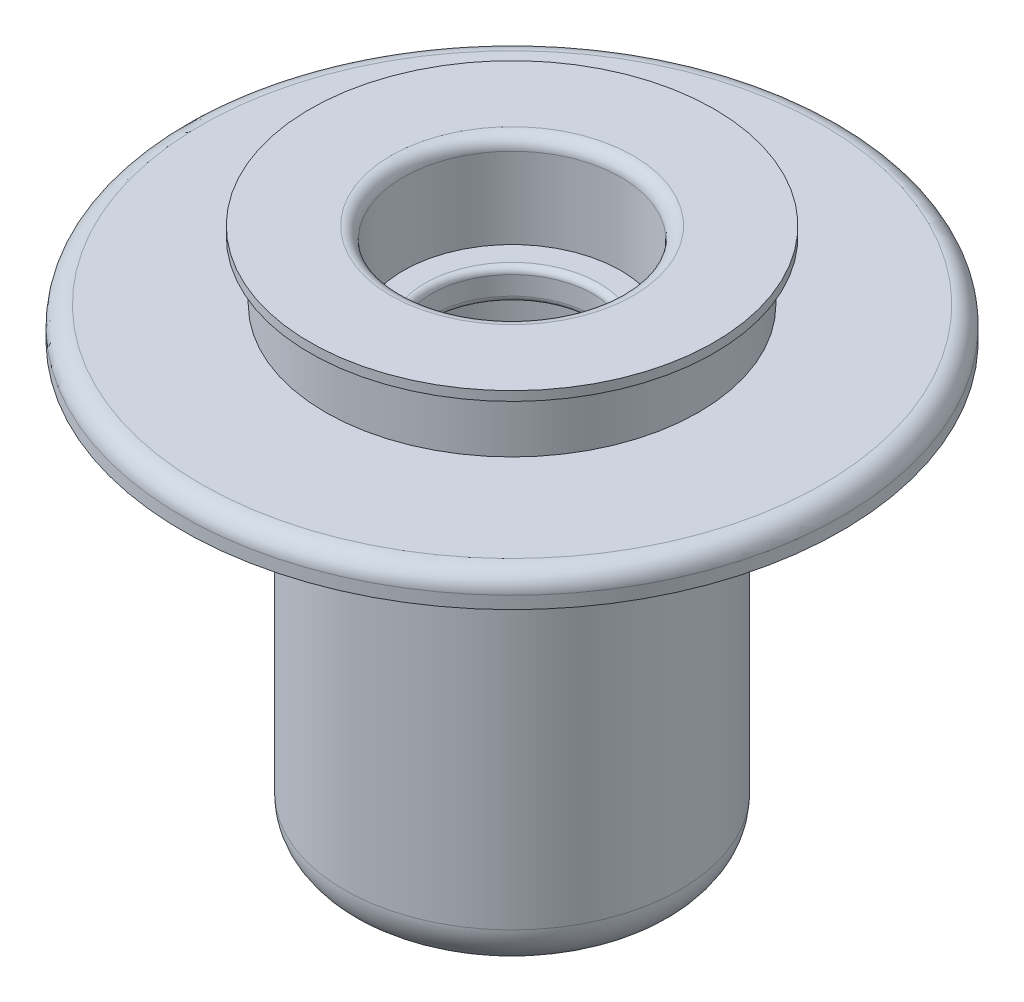
ISO-10303-21;
HEADER;
FILE_DESCRIPTION(('STEP AP214'),'2;1');
FILE_NAME('part.step','',(''),(''),'','','');
FILE_SCHEMA(('AUTOMOTIVE_DESIGN { 1 0 10303 214 1 1 1 1 }'));
ENDSEC;
DATA;
#1=APPLICATION_CONTEXT('core data for automotive mechanical design processes');
#2=APPLICATION_PROTOCOL_DEFINITION('international standard','automotive_design',2000,#1);
#3=PRODUCT_CONTEXT('',#1,'mechanical');
#4=PRODUCT('Part','Part','',(#3));
#5=PRODUCT_RELATED_PRODUCT_CATEGORY('part','',(#4));
#6=PRODUCT_DEFINITION_FORMATION('','',#4);
#7=PRODUCT_DEFINITION_CONTEXT('part definition',#1,'design');
#8=PRODUCT_DEFINITION('design','',#6,#7);
#9=PRODUCT_DEFINITION_SHAPE('','',#8);
#10=(LENGTH_UNIT() NAMED_UNIT(*) SI_UNIT(.MILLI.,.METRE.));
#11=(NAMED_UNIT(*) PLANE_ANGLE_UNIT() SI_UNIT($,.RADIAN.));
#12=(NAMED_UNIT(*) SI_UNIT($,.STERADIAN.) SOLID_ANGLE_UNIT());
#13=UNCERTAINTY_MEASURE_WITH_UNIT(LENGTH_MEASURE(1.E-05),#10,'distance_accuracy_value','');
#14=(GEOMETRIC_REPRESENTATION_CONTEXT(3) GLOBAL_UNCERTAINTY_ASSIGNED_CONTEXT((#13)) GLOBAL_UNIT_ASSIGNED_CONTEXT((#10,
#11,#12)) REPRESENTATION_CONTEXT('',''));
#15=CARTESIAN_POINT('',(0.,0.,0.));
#16=DIRECTION('',(0.,0.,1.));
#17=DIRECTION('',(1.,0.,0.));
#18=AXIS2_PLACEMENT_3D('',#15,#16,#17);
#19=CARTESIAN_POINT('',(50.,84.75825159929,0.));
#20=DIRECTION('',(0.,1.,0.));
#21=DIRECTION('',(0.,0.,1.));
#22=AXIS2_PLACEMENT_3D('',#19,#20,#21);
#23=PLANE('',#22);
#24=CARTESIAN_POINT('',(0.,84.75825159929,0.));
#25=DIRECTION('',(0.,-1.,0.));
#26=DIRECTION('',(0.,0.,-1.));
#27=AXIS2_PLACEMENT_3D('',#24,#25,#26);
#28=CIRCLE('',#27,30.);
#29=CARTESIAN_POINT('',(0.,84.75825159929,-30.));
#30=VERTEX_POINT('',#29);
#31=EDGE_CURVE('E222',#30,#30,#28,.T.);
#32=ORIENTED_EDGE('',*,*,#31,.T.);
#33=EDGE_LOOP('',(#32));
#34=FACE_BOUND('',#33,.T.);
#35=CARTESIAN_POINT('',(0.,84.75825159929,0.));
#36=DIRECTION('',(0.,-1.,0.));
#37=DIRECTION('',(0.,0.,-1.));
#38=AXIS2_PLACEMENT_3D('',#35,#36,#37);
#39=CIRCLE('',#38,50.);
#40=CARTESIAN_POINT('',(0.,84.75825159929,-50.));
#41=VERTEX_POINT('',#40);
#42=EDGE_CURVE('E141',#41,#41,#39,.T.);
#43=ORIENTED_EDGE('',*,*,#42,.F.);
#44=EDGE_LOOP('',(#43));
#45=FACE_BOUND('',#44,.T.);
#46=ADVANCED_FACE('F33',(#34,#45),#23,.T.);
#47=CARTESIAN_POINT('',(0.,0.,0.));
#48=DIRECTION('',(0.,-1.,0.));
#49=DIRECTION('',(0.,0.,-1.));
#50=AXIS2_PLACEMENT_3D('',#47,#48,#49);
#51=CYLINDRICAL_SURFACE('',#50,30.);
#52=CARTESIAN_POINT('',(0.,94.25825159929,0.));
#53=DIRECTION('',(0.,-1.,0.));
#54=DIRECTION('',(0.,0.,-1.));
#55=AXIS2_PLACEMENT_3D('',#52,#53,#54);
#56=CIRCLE('',#55,30.);
#57=CARTESIAN_POINT('',(0.,94.25825159929,-30.));
#58=VERTEX_POINT('',#57);
#59=EDGE_CURVE('E219',#58,#58,#56,.T.);
#60=ORIENTED_EDGE('',*,*,#59,.T.);
#61=EDGE_LOOP('',(#60));
#62=FACE_BOUND('',#61,.T.);
#63=ORIENTED_EDGE('',*,*,#31,.F.);
#64=EDGE_LOOP('',(#63));
#65=FACE_BOUND('',#64,.T.);
#66=ADVANCED_FACE('F356',(#62,#65),#51,.T.);
#67=CARTESIAN_POINT('',(32.5,94.25825159929,0.));
#68=DIRECTION('',(0.,-1.,0.));
#69=DIRECTION('',(0.,0.,-1.));
#70=AXIS2_PLACEMENT_3D('',#67,#68,#69);
#71=PLANE('',#70);
#72=CARTESIAN_POINT('',(0.,94.25825159929,0.));
#73=DIRECTION('',(0.,-1.,0.));
#74=DIRECTION('',(0.,0.,-1.));
#75=AXIS2_PLACEMENT_3D('',#72,#73,#74);
#76=CIRCLE('',#75,32.5);
#77=CARTESIAN_POINT('',(0.,94.25825159929,-32.5));
#78=VERTEX_POINT('',#77);
#79=EDGE_CURVE('E216',#78,#78,#76,.T.);
#80=ORIENTED_EDGE('',*,*,#79,.T.);
#81=EDGE_LOOP('',(#80));
#82=FACE_BOUND('',#81,.T.);
#83=ORIENTED_EDGE('',*,*,#59,.F.);
#84=EDGE_LOOP('',(#83));
#85=FACE_BOUND('',#84,.T.);
#86=ADVANCED_FACE('F350',(#82,#85),#71,.T.);
#87=CARTESIAN_POINT('',(0.,0.,0.));
#88=DIRECTION('',(0.,-1.,0.));
#89=DIRECTION('',(0.,0.,-1.));
#90=AXIS2_PLACEMENT_3D('',#87,#88,#89);
#91=CYLINDRICAL_SURFACE('',#90,32.5);
#92=CARTESIAN_POINT('',(0.,95.75825159929,0.));
#93=DIRECTION('',(0.,-1.,0.));
#94=DIRECTION('',(0.,0.,-1.));
#95=AXIS2_PLACEMENT_3D('',#92,#93,#94);
#96=CIRCLE('',#95,32.5);
#97=CARTESIAN_POINT('',(0.,95.75825159929,-32.5));
#98=VERTEX_POINT('',#97);
#99=EDGE_CURVE('E213',#98,#98,#96,.T.);
#100=ORIENTED_EDGE('',*,*,#99,.T.);
#101=EDGE_LOOP('',(#100));
#102=FACE_BOUND('',#101,.T.);
#103=ORIENTED_EDGE('',*,*,#79,.F.);
#104=EDGE_LOOP('',(#103));
#105=FACE_BOUND('',#104,.T.);
#106=ADVANCED_FACE('F344',(#102,#105),#91,.T.);
#107=CARTESIAN_POINT('',(19.5,95.75825159929,0.));
#108=DIRECTION('',(0.,1.,0.));
#109=DIRECTION('',(0.,0.,1.));
#110=AXIS2_PLACEMENT_3D('',#107,#108,#109);
#111=PLANE('',#110);
#112=CARTESIAN_POINT('',(0.,95.75825159929,0.));
#113=DIRECTION('',(0.,-1.,0.));
#114=DIRECTION('',(0.,0.,-1.));
#115=AXIS2_PLACEMENT_3D('',#112,#113,#114);
#116=CIRCLE('',#115,19.5);
#117=CARTESIAN_POINT('',(0.,95.75825159929,-19.5));
#118=VERTEX_POINT('',#117);
#119=EDGE_CURVE('E210',#118,#118,#116,.T.);
#120=ORIENTED_EDGE('',*,*,#119,.T.);
#121=EDGE_LOOP('',(#120));
#122=FACE_BOUND('',#121,.T.);
#123=ORIENTED_EDGE('',*,*,#99,.F.);
#124=EDGE_LOOP('',(#123));
#125=FACE_BOUND('',#124,.T.);
#126=ADVANCED_FACE('F338',(#122,#125),#111,.T.);
#127=CARTESIAN_POINT('',(0.,93.75825159929,0.));
#128=DIRECTION('',(0.,-1.,0.));
#129=DIRECTION('',(0.,0.,-1.));
#130=AXIS2_PLACEMENT_3D('',#127,#128,#129);
#131=TOROIDAL_SURFACE('',#130,19.5,2.);
#132=CARTESIAN_POINT('',(0.,93.75825159929,0.));
#133=DIRECTION('',(0.,-1.,0.));
#134=DIRECTION('',(0.,0.,-1.));
#135=AXIS2_PLACEMENT_3D('',#132,#133,#134);
#136=CIRCLE('',#135,17.5);
#137=CARTESIAN_POINT('',(0.,93.75825159929,-17.5));
#138=VERTEX_POINT('',#137);
#139=EDGE_CURVE('E207',#138,#138,#136,.T.);
#140=ORIENTED_EDGE('',*,*,#139,.T.);
#141=EDGE_LOOP('',(#140));
#142=FACE_BOUND('',#141,.T.);
#143=ORIENTED_EDGE('',*,*,#119,.F.);
#144=EDGE_LOOP('',(#143));
#145=FACE_BOUND('',#144,.T.);
#146=ADVANCED_FACE('F332',(#142,#145),#131,.T.);
#147=CARTESIAN_POINT('',(0.,0.,0.));
#148=DIRECTION('',(0.,-1.,0.));
#149=DIRECTION('',(0.,0.,-1.));
#150=AXIS2_PLACEMENT_3D('',#147,#148,#149);
#151=CYLINDRICAL_SURFACE('',#150,17.5);
#152=CARTESIAN_POINT('',(0.,80.75825159929,0.));
#153=DIRECTION('',(0.,-1.,0.));
#154=DIRECTION('',(0.,0.,-1.));
#155=AXIS2_PLACEMENT_3D('',#152,#153,#154);
#156=CIRCLE('',#155,17.5);
#157=CARTESIAN_POINT('',(0.,80.75825159929,-17.5));
#158=VERTEX_POINT('',#157);
#159=EDGE_CURVE('E204',#158,#158,#156,.T.);
#160=ORIENTED_EDGE('',*,*,#159,.T.);
#161=EDGE_LOOP('',(#160));
#162=FACE_BOUND('',#161,.T.);
#163=ORIENTED_EDGE('',*,*,#139,.F.);
#164=EDGE_LOOP('',(#163));
#165=FACE_BOUND('',#164,.T.);
#166=ADVANCED_FACE('F326',(#162,#165),#151,.F.);
#167=CARTESIAN_POINT('',(14.,80.75825159929,0.));
#168=DIRECTION('',(0.,1.,0.));
#169=DIRECTION('',(0.,0.,1.));
#170=AXIS2_PLACEMENT_3D('',#167,#168,#169);
#171=PLANE('',#170);
#172=CARTESIAN_POINT('',(0.,80.75825159929,0.));
#173=DIRECTION('',(0.,-1.,0.));
#174=DIRECTION('',(0.,0.,-1.));
#175=AXIS2_PLACEMENT_3D('',#172,#173,#174);
#176=CIRCLE('',#175,14.);
#177=CARTESIAN_POINT('',(0.,80.75825159929,-14.));
#178=VERTEX_POINT('',#177);
#179=EDGE_CURVE('E201',#178,#178,#176,.T.);
#180=ORIENTED_EDGE('',*,*,#179,.T.);
#181=EDGE_LOOP('',(#180));
#182=FACE_BOUND('',#181,.T.);
#183=ORIENTED_EDGE('',*,*,#159,.F.);
#184=EDGE_LOOP('',(#183));
#185=FACE_BOUND('',#184,.T.);
#186=ADVANCED_FACE('F320',(#182,#185),#171,.T.);
#187=CARTESIAN_POINT('',(0.,79.75825159929,0.));
#188=DIRECTION('',(0.,-1.,0.));
#189=DIRECTION('',(0.,0.,-1.));
#190=AXIS2_PLACEMENT_3D('',#187,#188,#189);
#191=TOROIDAL_SURFACE('',#190,14.,0.999999999999994);
#192=CARTESIAN_POINT('',(0.,79.75825159929,0.));
#193=DIRECTION('',(0.,-1.,0.));
#194=DIRECTION('',(0.,0.,-1.));
#195=AXIS2_PLACEMENT_3D('',#192,#193,#194);
#196=CIRCLE('',#195,13.);
#197=CARTESIAN_POINT('',(0.,79.75825159929,-13.));
#198=VERTEX_POINT('',#197);
#199=EDGE_CURVE('E198',#198,#198,#196,.T.);
#200=ORIENTED_EDGE('',*,*,#199,.T.);
#201=EDGE_LOOP('',(#200));
#202=FACE_BOUND('',#201,.T.);
#203=ORIENTED_EDGE('',*,*,#179,.F.);
#204=EDGE_LOOP('',(#203));
#205=FACE_BOUND('',#204,.T.);
#206=ADVANCED_FACE('F314',(#202,#205),#191,.T.);
#207=CARTESIAN_POINT('',(0.,0.,0.));
#208=DIRECTION('',(0.,-1.,0.));
#209=DIRECTION('',(0.,0.,-1.));
#210=AXIS2_PLACEMENT_3D('',#207,#208,#209);
#211=CYLINDRICAL_SURFACE('',#210,13.);
#212=CARTESIAN_POINT('',(0.,76.75825159929,0.));
#213=DIRECTION('',(0.,-1.,0.));
#214=DIRECTION('',(0.,0.,-1.));
#215=AXIS2_PLACEMENT_3D('',#212,#213,#214);
#216=CIRCLE('',#215,13.);
#217=CARTESIAN_POINT('',(0.,76.75825159929,-13.));
#218=VERTEX_POINT('',#217);
#219=EDGE_CURVE('E195',#218,#218,#216,.T.);
#220=ORIENTED_EDGE('',*,*,#219,.T.);
#221=EDGE_LOOP('',(#220));
#222=FACE_BOUND('',#221,.T.);
#223=ORIENTED_EDGE('',*,*,#199,.F.);
#224=EDGE_LOOP('',(#223));
#225=FACE_BOUND('',#224,.T.);
#226=ADVANCED_FACE('F308',(#222,#225),#211,.F.);
#227=CARTESIAN_POINT('',(0.,76.75825159929,0.));
#228=DIRECTION('',(0.,-1.,0.));
#229=DIRECTION('',(0.,0.,-1.));
#230=AXIS2_PLACEMENT_3D('',#227,#228,#229);
#231=TOROIDAL_SURFACE('',#230,14.,1.00000000000001);
#232=CARTESIAN_POINT('',(0.,75.75825159929,0.));
#233=DIRECTION('',(0.,-1.,0.));
#234=DIRECTION('',(0.,0.,-1.));
#235=AXIS2_PLACEMENT_3D('',#232,#233,#234);
#236=CIRCLE('',#235,14.);
#237=CARTESIAN_POINT('',(0.,75.75825159929,-14.));
#238=VERTEX_POINT('',#237);
#239=EDGE_CURVE('E192',#238,#238,#236,.T.);
#240=ORIENTED_EDGE('',*,*,#239,.T.);
#241=EDGE_LOOP('',(#240));
#242=FACE_BOUND('',#241,.T.);
#243=ORIENTED_EDGE('',*,*,#219,.F.);
#244=EDGE_LOOP('',(#243));
#245=FACE_BOUND('',#244,.T.);
#246=ADVANCED_FACE('F302',(#242,#245),#231,.T.);
#247=CARTESIAN_POINT('',(14.,75.75825159929,0.));
#248=DIRECTION('',(0.,-1.,0.));
#249=DIRECTION('',(0.,0.,-1.));
#250=AXIS2_PLACEMENT_3D('',#247,#248,#249);
#251=PLANE('',#250);
#252=CARTESIAN_POINT('',(0.,75.75825159929,0.));
#253=DIRECTION('',(0.,-1.,0.));
#254=DIRECTION('',(0.,0.,-1.));
#255=AXIS2_PLACEMENT_3D('',#252,#253,#254);
#256=CIRCLE('',#255,22.);
#257=CARTESIAN_POINT('',(0.,75.75825159929,-22.));
#258=VERTEX_POINT('',#257);
#259=EDGE_CURVE('E189',#258,#258,#256,.T.);
#260=ORIENTED_EDGE('',*,*,#259,.T.);
#261=EDGE_LOOP('',(#260));
#262=FACE_BOUND('',#261,.T.);
#263=ORIENTED_EDGE('',*,*,#239,.F.);
#264=EDGE_LOOP('',(#263));
#265=FACE_BOUND('',#264,.T.);
#266=ADVANCED_FACE('F296',(#262,#265),#251,.T.);
#267=CARTESIAN_POINT('',(0.,0.,0.));
#268=DIRECTION('',(0.,-1.,0.));
#269=DIRECTION('',(0.,0.,-1.));
#270=AXIS2_PLACEMENT_3D('',#267,#268,#269);
#271=CYLINDRICAL_SURFACE('',#270,22.);
#272=CARTESIAN_POINT('',(0.,35.75825159929,0.));
#273=DIRECTION('',(0.,-1.,0.));
#274=DIRECTION('',(0.,0.,-1.));
#275=AXIS2_PLACEMENT_3D('',#272,#273,#274);
#276=CIRCLE('',#275,22.);
#277=CARTESIAN_POINT('',(0.,35.75825159929,-22.));
#278=VERTEX_POINT('',#277);
#279=EDGE_CURVE('E186',#278,#278,#276,.T.);
#280=ORIENTED_EDGE('',*,*,#279,.T.);
#281=EDGE_LOOP('',(#280));
#282=FACE_BOUND('',#281,.T.);
#283=ORIENTED_EDGE('',*,*,#259,.F.);
#284=EDGE_LOOP('',(#283));
#285=FACE_BOUND('',#284,.T.);
#286=ADVANCED_FACE('F290',(#282,#285),#271,.F.);
#287=CARTESIAN_POINT('',(22.,35.75825159929,0.));
#288=DIRECTION('',(0.,1.,0.));
#289=DIRECTION('',(0.,0.,1.));
#290=AXIS2_PLACEMENT_3D('',#287,#288,#289);
#291=PLANE('',#290);
#292=CARTESIAN_POINT('',(0.,35.75825159929,0.));
#293=DIRECTION('',(0.,-1.,0.));
#294=DIRECTION('',(0.,0.,-1.));
#295=AXIS2_PLACEMENT_3D('',#292,#293,#294);
#296=CIRCLE('',#295,14.);
#297=CARTESIAN_POINT('',(0.,35.75825159929,-14.));
#298=VERTEX_POINT('',#297);
#299=EDGE_CURVE('E183',#298,#298,#296,.T.);
#300=ORIENTED_EDGE('',*,*,#299,.T.);
#301=EDGE_LOOP('',(#300));
#302=FACE_BOUND('',#301,.T.);
#303=ORIENTED_EDGE('',*,*,#279,.F.);
#304=EDGE_LOOP('',(#303));
#305=FACE_BOUND('',#304,.T.);
#306=ADVANCED_FACE('F284',(#302,#305),#291,.T.);
#307=CARTESIAN_POINT('',(0.,34.75825159929,0.));
#308=DIRECTION('',(0.,-1.,0.));
#309=DIRECTION('',(0.,0.,-1.));
#310=AXIS2_PLACEMENT_3D('',#307,#308,#309);
#311=TOROIDAL_SURFACE('',#310,14.,0.999999999999997);
#312=CARTESIAN_POINT('',(0.,34.75825159929,0.));
#313=DIRECTION('',(0.,-1.,0.));
#314=DIRECTION('',(0.,0.,-1.));
#315=AXIS2_PLACEMENT_3D('',#312,#313,#314);
#316=CIRCLE('',#315,13.);
#317=CARTESIAN_POINT('',(0.,34.75825159929,-13.));
#318=VERTEX_POINT('',#317);
#319=EDGE_CURVE('E180',#318,#318,#316,.T.);
#320=ORIENTED_EDGE('',*,*,#319,.T.);
#321=EDGE_LOOP('',(#320));
#322=FACE_BOUND('',#321,.T.);
#323=ORIENTED_EDGE('',*,*,#299,.F.);
#324=EDGE_LOOP('',(#323));
#325=FACE_BOUND('',#324,.T.);
#326=ADVANCED_FACE('F278',(#322,#325),#311,.T.);
#327=CARTESIAN_POINT('',(0.,0.,0.));
#328=DIRECTION('',(0.,-1.,0.));
#329=DIRECTION('',(0.,0.,-1.));
#330=AXIS2_PLACEMENT_3D('',#327,#328,#329);
#331=CYLINDRICAL_SURFACE('',#330,13.);
#332=CARTESIAN_POINT('',(0.,31.75825159929,0.));
#333=DIRECTION('',(0.,-1.,0.));
#334=DIRECTION('',(0.,0.,-1.));
#335=AXIS2_PLACEMENT_3D('',#332,#333,#334);
#336=CIRCLE('',#335,13.);
#337=CARTESIAN_POINT('',(0.,31.75825159929,-13.));
#338=VERTEX_POINT('',#337);
#339=EDGE_CURVE('E177',#338,#338,#336,.T.);
#340=ORIENTED_EDGE('',*,*,#339,.T.);
#341=EDGE_LOOP('',(#340));
#342=FACE_BOUND('',#341,.T.);
#343=ORIENTED_EDGE('',*,*,#319,.F.);
#344=EDGE_LOOP('',(#343));
#345=FACE_BOUND('',#344,.T.);
#346=ADVANCED_FACE('F272',(#342,#345),#331,.F.);
#347=CARTESIAN_POINT('',(0.,31.75825159929,0.));
#348=DIRECTION('',(0.,-1.,0.));
#349=DIRECTION('',(0.,0.,-1.));
#350=AXIS2_PLACEMENT_3D('',#347,#348,#349);
#351=TOROIDAL_SURFACE('',#350,14.,0.999999999999997);
#352=CARTESIAN_POINT('',(0.,30.7582515992901,0.));
#353=DIRECTION('',(0.,-1.,0.));
#354=DIRECTION('',(0.,0.,-1.));
#355=AXIS2_PLACEMENT_3D('',#352,#353,#354);
#356=CIRCLE('',#355,14.);
#357=CARTESIAN_POINT('',(0.,30.7582515992901,-14.));
#358=VERTEX_POINT('',#357);
#359=EDGE_CURVE('E174',#358,#358,#356,.T.);
#360=ORIENTED_EDGE('',*,*,#359,.T.);
#361=EDGE_LOOP('',(#360));
#362=FACE_BOUND('',#361,.T.);
#363=ORIENTED_EDGE('',*,*,#339,.F.);
#364=EDGE_LOOP('',(#363));
#365=FACE_BOUND('',#364,.T.);
#366=ADVANCED_FACE('F266',(#362,#365),#351,.T.);
#367=CARTESIAN_POINT('',(17.5,30.7582515992901,0.));
#368=DIRECTION('',(0.,-1.,0.));
#369=DIRECTION('',(0.,0.,-1.));
#370=AXIS2_PLACEMENT_3D('',#367,#368,#369);
#371=PLANE('',#370);
#372=CARTESIAN_POINT('',(0.,30.7582515992901,0.));
#373=DIRECTION('',(0.,-1.,0.));
#374=DIRECTION('',(0.,0.,-1.));
#375=AXIS2_PLACEMENT_3D('',#372,#373,#374);
#376=CIRCLE('',#375,17.5);
#377=CARTESIAN_POINT('',(0.,30.7582515992901,-17.5));
#378=VERTEX_POINT('',#377);
#379=EDGE_CURVE('E171',#378,#378,#376,.T.);
#380=ORIENTED_EDGE('',*,*,#379,.T.);
#381=EDGE_LOOP('',(#380));
#382=FACE_BOUND('',#381,.T.);
#383=ORIENTED_EDGE('',*,*,#359,.F.);
#384=EDGE_LOOP('',(#383));
#385=FACE_BOUND('',#384,.T.);
#386=ADVANCED_FACE('F260',(#382,#385),#371,.T.);
#387=CARTESIAN_POINT('',(0.,0.,0.));
#388=DIRECTION('',(0.,-1.,0.));
#389=DIRECTION('',(0.,0.,-1.));
#390=AXIS2_PLACEMENT_3D('',#387,#388,#389);
#391=CYLINDRICAL_SURFACE('',#390,17.5);
#392=DIRECTION('',(0.,-1.,0.));
#393=VECTOR('',#392,1.);
#394=CARTESIAN_POINT('',(-17.5,0.,0.));
#395=LINE('',#394,#393);
#396=CARTESIAN_POINT('',(-17.5,30.75,0.));
#397=VERTEX_POINT('',#396);
#398=CARTESIAN_POINT('',(-17.5,19.7582515992901,0.));
#399=VERTEX_POINT('',#398);
#400=EDGE_CURVE('E139',#397,#399,#395,.T.);
#401=ORIENTED_EDGE('',*,*,#400,.F.);
#402=CARTESIAN_POINT('',(0.,30.75,0.));
#403=DIRECTION('',(0.,1.,0.));
#404=DIRECTION('',(-1.,0.,0.));
#405=AXIS2_PLACEMENT_3D('',#402,#403,#404);
#406=CIRCLE('',#405,17.5);
#407=CARTESIAN_POINT('',(17.5,30.75,0.));
#408=VERTEX_POINT('',#407);
#409=EDGE_CURVE('E132',#408,#397,#406,.T.);
#410=ORIENTED_EDGE('',*,*,#409,.F.);
#411=DIRECTION('',(0.,-1.,0.));
#412=VECTOR('',#411,1.);
#413=CARTESIAN_POINT('',(17.5,0.,0.));
#414=LINE('',#413,#412);
#415=CARTESIAN_POINT('',(17.5,19.7582515992901,0.));
#416=VERTEX_POINT('',#415);
#417=EDGE_CURVE('E136',#416,#408,#414,.F.);
#418=ORIENTED_EDGE('',*,*,#417,.F.);
#419=CARTESIAN_POINT('',(0.,19.7582515992901,0.));
#420=DIRECTION('',(0.,-1.,0.));
#421=DIRECTION('',(0.,0.,-1.));
#422=AXIS2_PLACEMENT_3D('',#419,#420,#421);
#423=CIRCLE('',#422,17.5);
#424=EDGE_CURVE('E168',#416,#399,#423,.T.);
#425=ORIENTED_EDGE('',*,*,#424,.T.);
#426=EDGE_LOOP('',(#401,#410,#418,#425));
#427=FACE_BOUND('',#426,.T.);
#428=ORIENTED_EDGE('',*,*,#379,.F.);
#429=EDGE_LOOP('',(#428));
#430=FACE_BOUND('',#429,.T.);
#431=ADVANCED_FACE('F257',(#427,#430),#391,.F.);
#432=CARTESIAN_POINT('',(13.5,19.7582515992901,0.));
#433=DIRECTION('',(0.,1.,0.));
#434=DIRECTION('',(0.,0.,1.));
#435=AXIS2_PLACEMENT_3D('',#432,#433,#434);
#436=PLANE('',#435);
#437=DIRECTION('',(1.,0.,0.));
#438=VECTOR('',#437,1.);
#439=CARTESIAN_POINT('',(13.5,19.7582515992901,0.));
#440=LINE('',#439,#438);
#441=CARTESIAN_POINT('',(-13.5,19.7582515992901,0.));
#442=VERTEX_POINT('',#441);
#443=EDGE_CURVE('E137',#399,#442,#440,.T.);
#444=ORIENTED_EDGE('',*,*,#443,.F.);
#445=ORIENTED_EDGE('',*,*,#424,.F.);
#446=CARTESIAN_POINT('',(13.5,19.7582515992901,0.));
#447=VERTEX_POINT('',#446);
#448=EDGE_CURVE('E134',#447,#416,#440,.T.);
#449=ORIENTED_EDGE('',*,*,#448,.F.);
#450=CARTESIAN_POINT('',(0.,19.7582515992901,0.));
#451=DIRECTION('',(0.,-1.,0.));
#452=DIRECTION('',(0.,0.,-1.));
#453=AXIS2_PLACEMENT_3D('',#450,#451,#452);
#454=CIRCLE('',#453,13.5);
#455=EDGE_CURVE('E165',#447,#442,#454,.T.);
#456=ORIENTED_EDGE('',*,*,#455,.T.);
#457=EDGE_LOOP('',(#444,#445,#449,#456));
#458=FACE_BOUND('',#457,.T.);
#459=ADVANCED_FACE('F240',(#458),#436,.T.);
#460=CARTESIAN_POINT('',(0.,18.7582515992901,0.));
#461=DIRECTION('',(0.,-1.,0.));
#462=DIRECTION('',(0.,0.,-1.));
#463=AXIS2_PLACEMENT_3D('',#460,#461,#462);
#464=TOROIDAL_SURFACE('',#463,13.5,1.);
#465=CARTESIAN_POINT('',(-13.5,18.7582515992901,0.));
#466=DIRECTION('',(0.,0.,1.));
#467=DIRECTION('',(1.,0.,0.));
#468=AXIS2_PLACEMENT_3D('',#465,#466,#467);
#469=CIRCLE('',#468,1.);
#470=CARTESIAN_POINT('',(-12.6292626627971,19.25,0.));
#471=VERTEX_POINT('',#470);
#472=EDGE_CURVE('E11',#442,#471,#469,.F.);
#473=ORIENTED_EDGE('',*,*,#472,.F.);
#474=ORIENTED_EDGE('',*,*,#455,.F.);
#475=CARTESIAN_POINT('',(13.5,18.7582515992901,0.));
#476=DIRECTION('',(0.,0.,1.));
#477=DIRECTION('',(1.,0.,0.));
#478=AXIS2_PLACEMENT_3D('',#475,#476,#477);
#479=CIRCLE('',#478,1.);
#480=CARTESIAN_POINT('',(12.6292626627971,19.25,0.));
#481=VERTEX_POINT('',#480);
#482=EDGE_CURVE('E40',#481,#447,#479,.F.);
#483=ORIENTED_EDGE('',*,*,#482,.F.);
#484=CARTESIAN_POINT('',(0.,19.25,0.));
#485=DIRECTION('',(0.,1.,0.));
#486=DIRECTION('',(-1.,0.,0.));
#487=AXIS2_PLACEMENT_3D('',#484,#485,#486);
#488=CIRCLE('',#487,12.6292626627971);
#489=EDGE_CURVE('E127',#471,#481,#488,.F.);
#490=ORIENTED_EDGE('',*,*,#489,.F.);
#491=EDGE_LOOP('',(#473,#474,#483,#490));
#492=FACE_BOUND('',#491,.T.);
#493=CARTESIAN_POINT('',(0.,18.7582515992901,0.));
#494=DIRECTION('',(0.,-1.,0.));
#495=DIRECTION('',(0.,0.,-1.));
#496=AXIS2_PLACEMENT_3D('',#493,#494,#495);
#497=CIRCLE('',#496,12.5);
#498=CARTESIAN_POINT('',(0.,18.7582515992901,-12.5));
#499=VERTEX_POINT('',#498);
#500=EDGE_CURVE('E162',#499,#499,#497,.T.);
#501=ORIENTED_EDGE('',*,*,#500,.T.);
#502=EDGE_LOOP('',(#501));
#503=FACE_BOUND('',#502,.T.);
#504=ADVANCED_FACE('F241',(#492,#503),#464,.T.);
#505=CARTESIAN_POINT('',(0.,0.,0.));
#506=DIRECTION('',(0.,-1.,0.));
#507=DIRECTION('',(0.,0.,-1.));
#508=AXIS2_PLACEMENT_3D('',#505,#506,#507);
#509=CYLINDRICAL_SURFACE('',#508,12.5);
#510=CARTESIAN_POINT('',(0.,9.75825159929005,0.));
#511=DIRECTION('',(0.,-1.,0.));
#512=DIRECTION('',(0.,0.,-1.));
#513=AXIS2_PLACEMENT_3D('',#510,#511,#512);
#514=CIRCLE('',#513,12.5);
#515=CARTESIAN_POINT('',(0.,9.75825159929005,-12.5));
#516=VERTEX_POINT('',#515);
#517=EDGE_CURVE('E159',#516,#516,#514,.T.);
#518=ORIENTED_EDGE('',*,*,#517,.T.);
#519=EDGE_LOOP('',(#518));
#520=FACE_BOUND('',#519,.T.);
#521=ORIENTED_EDGE('',*,*,#500,.F.);
#522=EDGE_LOOP('',(#521));
#523=FACE_BOUND('',#522,.T.);
#524=ADVANCED_FACE('F399',(#520,#523),#509,.F.);
#525=CARTESIAN_POINT('',(20.,9.75825159929005,0.));
#526=DIRECTION('',(0.,-1.,0.));
#527=DIRECTION('',(0.,0.,-1.));
#528=AXIS2_PLACEMENT_3D('',#525,#526,#527);
#529=PLANE('',#528);
#530=CARTESIAN_POINT('',(0.,9.75825159929005,0.));
#531=DIRECTION('',(0.,-1.,0.));
#532=DIRECTION('',(0.,0.,-1.));
#533=AXIS2_PLACEMENT_3D('',#530,#531,#532);
#534=CIRCLE('',#533,20.);
#535=CARTESIAN_POINT('',(0.,9.75825159929005,-20.));
#536=VERTEX_POINT('',#535);
#537=EDGE_CURVE('E156',#536,#536,#534,.T.);
#538=ORIENTED_EDGE('',*,*,#537,.T.);
#539=EDGE_LOOP('',(#538));
#540=FACE_BOUND('',#539,.T.);
#541=ORIENTED_EDGE('',*,*,#517,.F.);
#542=EDGE_LOOP('',(#541));
#543=FACE_BOUND('',#542,.T.);
#544=ADVANCED_FACE('F393',(#540,#543),#529,.T.);
#545=CARTESIAN_POINT('',(0.,16.7582515992901,0.));
#546=DIRECTION('',(0.,-1.,0.));
#547=DIRECTION('',(0.,0.,-1.));
#548=AXIS2_PLACEMENT_3D('',#545,#546,#547);
#549=TOROIDAL_SURFACE('',#548,20.,7.);
#550=CARTESIAN_POINT('',(0.,16.7582515992901,0.));
#551=DIRECTION('',(0.,-1.,0.));
#552=DIRECTION('',(0.,0.,-1.));
#553=AXIS2_PLACEMENT_3D('',#550,#551,#552);
#554=CIRCLE('',#553,27.);
#555=CARTESIAN_POINT('',(0.,16.7582515992901,-27.));
#556=VERTEX_POINT('',#555);
#557=EDGE_CURVE('E153',#556,#556,#554,.T.);
#558=ORIENTED_EDGE('',*,*,#557,.T.);
#559=EDGE_LOOP('',(#558));
#560=FACE_BOUND('',#559,.T.);
#561=ORIENTED_EDGE('',*,*,#537,.F.);
#562=EDGE_LOOP('',(#561));
#563=FACE_BOUND('',#562,.T.);
#564=ADVANCED_FACE('F387',(#560,#563),#549,.T.);
#565=CARTESIAN_POINT('',(0.,0.,0.));
#566=DIRECTION('',(0.,-1.,0.));
#567=DIRECTION('',(0.,0.,-1.));
#568=AXIS2_PLACEMENT_3D('',#565,#566,#567);
#569=CYLINDRICAL_SURFACE('',#568,27.);
#570=DIRECTION('',(0.,-1.,0.));
#571=VECTOR('',#570,1.);
#572=CARTESIAN_POINT('',(-19.,0.,-19.1833260932509));
#573=LINE('',#572,#571);
#574=CARTESIAN_POINT('',(-19.,19.25,-19.1833260932509));
#575=VERTEX_POINT('',#574);
#576=CARTESIAN_POINT('',(-19.,30.75,-19.1833260932509));
#577=VERTEX_POINT('',#576);
#578=EDGE_CURVE('E230',#575,#577,#573,.F.);
#579=ORIENTED_EDGE('',*,*,#578,.F.);
#580=CARTESIAN_POINT('',(0.,19.25,0.));
#581=DIRECTION('',(0.,-1.,0.));
#582=DIRECTION('',(1.,0.,0.));
#583=AXIS2_PLACEMENT_3D('',#580,#581,#582);
#584=CIRCLE('',#583,27.);
#585=CARTESIAN_POINT('',(19.,19.25,-19.1833260932509));
#586=VERTEX_POINT('',#585);
#587=EDGE_CURVE('E101',#586,#575,#584,.F.);
#588=ORIENTED_EDGE('',*,*,#587,.F.);
#589=DIRECTION('',(0.,-1.,0.));
#590=VECTOR('',#589,1.);
#591=CARTESIAN_POINT('',(19.,0.,-19.1833260932509));
#592=LINE('',#591,#590);
#593=CARTESIAN_POINT('',(19.,30.75,-19.1833260932509));
#594=VERTEX_POINT('',#593);
#595=EDGE_CURVE('E226',#594,#586,#592,.T.);
#596=ORIENTED_EDGE('',*,*,#595,.F.);
#597=CARTESIAN_POINT('',(0.,30.75,0.));
#598=DIRECTION('',(0.,1.,0.));
#599=DIRECTION('',(-1.,0.,0.));
#600=AXIS2_PLACEMENT_3D('',#597,#598,#599);
#601=CIRCLE('',#600,27.);
#602=EDGE_CURVE('E228',#577,#594,#601,.F.);
#603=ORIENTED_EDGE('',*,*,#602,.F.);
#604=EDGE_LOOP('',(#579,#588,#596,#603));
#605=FACE_BOUND('',#604,.T.);
#606=CARTESIAN_POINT('',(0.,79.75825159929,0.));
#607=DIRECTION('',(0.,-1.,0.));
#608=DIRECTION('',(0.,0.,-1.));
#609=AXIS2_PLACEMENT_3D('',#606,#607,#608);
#610=CIRCLE('',#609,27.);
#611=CARTESIAN_POINT('',(0.,79.75825159929,-27.));
#612=VERTEX_POINT('',#611);
#613=EDGE_CURVE('E150',#612,#612,#610,.T.);
#614=ORIENTED_EDGE('',*,*,#613,.T.);
#615=EDGE_LOOP('',(#614));
#616=FACE_BOUND('',#615,.T.);
#617=ORIENTED_EDGE('',*,*,#557,.F.);
#618=EDGE_LOOP('',(#617));
#619=FACE_BOUND('',#618,.T.);
#620=ADVANCED_FACE('F250',(#605,#616,#619),#569,.T.);
#621=CARTESIAN_POINT('',(27.,79.75825159929,0.));
#622=DIRECTION('',(0.,-1.,0.));
#623=DIRECTION('',(0.,0.,-1.));
#624=AXIS2_PLACEMENT_3D('',#621,#622,#623);
#625=PLANE('',#624);
#626=CARTESIAN_POINT('',(0.,79.75825159929,0.));
#627=DIRECTION('',(0.,-1.,0.));
#628=DIRECTION('',(0.,0.,-1.));
#629=AXIS2_PLACEMENT_3D('',#626,#627,#628);
#630=CIRCLE('',#629,53.);
#631=CARTESIAN_POINT('',(0.,79.75825159929,-53.));
#632=VERTEX_POINT('',#631);
#633=EDGE_CURVE('E147',#632,#632,#630,.T.);
#634=ORIENTED_EDGE('',*,*,#633,.T.);
#635=EDGE_LOOP('',(#634));
#636=FACE_BOUND('',#635,.T.);
#637=ORIENTED_EDGE('',*,*,#613,.F.);
#638=EDGE_LOOP('',(#637));
#639=FACE_BOUND('',#638,.T.);
#640=ADVANCED_FACE('F377',(#636,#639),#625,.T.);
#641=CARTESIAN_POINT('',(0.,0.,0.));
#642=DIRECTION('',(0.,-1.,0.));
#643=DIRECTION('',(0.,0.,-1.));
#644=AXIS2_PLACEMENT_3D('',#641,#642,#643);
#645=CYLINDRICAL_SURFACE('',#644,53.);
#646=CARTESIAN_POINT('',(0.,81.75825159929,0.));
#647=DIRECTION('',(0.,-1.,0.));
#648=DIRECTION('',(0.,0.,-1.));
#649=AXIS2_PLACEMENT_3D('',#646,#647,#648);
#650=CIRCLE('',#649,53.);
#651=CARTESIAN_POINT('',(0.,81.75825159929,-53.));
#652=VERTEX_POINT('',#651);
#653=EDGE_CURVE('E144',#652,#652,#650,.T.);
#654=ORIENTED_EDGE('',*,*,#653,.T.);
#655=EDGE_LOOP('',(#654));
#656=FACE_BOUND('',#655,.T.);
#657=ORIENTED_EDGE('',*,*,#633,.F.);
#658=EDGE_LOOP('',(#657));
#659=FACE_BOUND('',#658,.T.);
#660=ADVANCED_FACE('F371',(#656,#659),#645,.T.);
#661=CARTESIAN_POINT('',(0.,81.75825159929,0.));
#662=DIRECTION('',(0.,-1.,0.));
#663=DIRECTION('',(0.,0.,-1.));
#664=AXIS2_PLACEMENT_3D('',#661,#662,#663);
#665=TOROIDAL_SURFACE('',#664,50.,3.);
#666=ORIENTED_EDGE('',*,*,#42,.T.);
#667=EDGE_LOOP('',(#666));
#668=FACE_BOUND('',#667,.T.);
#669=ORIENTED_EDGE('',*,*,#653,.F.);
#670=EDGE_LOOP('',(#669));
#671=FACE_BOUND('',#670,.T.);
#672=ADVANCED_FACE('F368',(#668,#671),#665,.T.);
#673=CARTESIAN_POINT('',(0.,0.,0.));
#674=DIRECTION('',(0.,0.,1.));
#675=DIRECTION('',(1.,0.,0.));
#676=AXIS2_PLACEMENT_3D('',#673,#674,#675);
#677=PLANE('',#676);
#678=ORIENTED_EDGE('',*,*,#400,.T.);
#679=ORIENTED_EDGE('',*,*,#443,.T.);
#680=ORIENTED_EDGE('',*,*,#472,.T.);
#681=DIRECTION('',(1.,0.,0.));
#682=VECTOR('',#681,1.);
#683=CARTESIAN_POINT('',(19.,19.25,0.));
#684=LINE('',#683,#682);
#685=CARTESIAN_POINT('',(-19.,19.25,0.));
#686=VERTEX_POINT('',#685);
#687=EDGE_CURVE('E98',#686,#471,#684,.T.);
#688=ORIENTED_EDGE('',*,*,#687,.F.);
#689=DIRECTION('',(0.,-1.,0.));
#690=VECTOR('',#689,1.);
#691=CARTESIAN_POINT('',(-19.,19.25,0.));
#692=LINE('',#691,#690);
#693=CARTESIAN_POINT('',(-19.,30.75,0.));
#694=VERTEX_POINT('',#693);
#695=EDGE_CURVE('E111',#694,#686,#692,.T.);
#696=ORIENTED_EDGE('',*,*,#695,.F.);
#697=DIRECTION('',(-1.,0.,0.));
#698=VECTOR('',#697,1.);
#699=CARTESIAN_POINT('',(19.,30.75,0.));
#700=LINE('',#699,#698);
#701=EDGE_CURVE('E123',#397,#694,#700,.T.);
#702=ORIENTED_EDGE('',*,*,#701,.F.);
#703=EDGE_LOOP('',(#678,#679,#680,#688,#696,#702));
#704=FACE_BOUND('',#703,.T.);
#705=ADVANCED_FACE('F109',(#704),#677,.F.);
#706=CARTESIAN_POINT('',(-19.,19.25,-40.));
#707=DIRECTION('',(-1.,0.,0.));
#708=DIRECTION('',(0.,0.,1.));
#709=AXIS2_PLACEMENT_3D('',#706,#707,#708);
#710=PLANE('',#709);
#711=ORIENTED_EDGE('',*,*,#578,.T.);
#712=DIRECTION('',(0.,0.,1.));
#713=VECTOR('',#712,1.);
#714=CARTESIAN_POINT('',(-19.,30.75,-40.));
#715=LINE('',#714,#713);
#716=EDGE_CURVE('E117',#577,#694,#715,.T.);
#717=ORIENTED_EDGE('',*,*,#716,.T.);
#718=ORIENTED_EDGE('',*,*,#695,.T.);
#719=DIRECTION('',(0.,0.,1.));
#720=VECTOR('',#719,1.);
#721=CARTESIAN_POINT('',(-19.,19.25,-40.));
#722=LINE('',#721,#720);
#723=EDGE_CURVE('E95',#575,#686,#722,.T.);
#724=ORIENTED_EDGE('',*,*,#723,.F.);
#725=EDGE_LOOP('',(#711,#717,#718,#724));
#726=FACE_BOUND('',#725,.T.);
#727=ADVANCED_FACE('F115',(#726),#710,.F.);
#728=CARTESIAN_POINT('',(19.,30.75,-40.));
#729=DIRECTION('',(0.,1.,0.));
#730=DIRECTION('',(-1.,0.,0.));
#731=AXIS2_PLACEMENT_3D('',#728,#729,#730);
#732=PLANE('',#731);
#733=ORIENTED_EDGE('',*,*,#409,.T.);
#734=ORIENTED_EDGE('',*,*,#701,.T.);
#735=ORIENTED_EDGE('',*,*,#716,.F.);
#736=ORIENTED_EDGE('',*,*,#602,.T.);
#737=DIRECTION('',(0.,0.,1.));
#738=VECTOR('',#737,1.);
#739=CARTESIAN_POINT('',(19.,30.75,-40.));
#740=LINE('',#739,#738);
#741=CARTESIAN_POINT('',(19.,30.75,0.));
#742=VERTEX_POINT('',#741);
#743=EDGE_CURVE('E128',#594,#742,#740,.T.);
#744=ORIENTED_EDGE('',*,*,#743,.T.);
#745=EDGE_CURVE('E105',#742,#408,#700,.T.);
#746=ORIENTED_EDGE('',*,*,#745,.T.);
#747=EDGE_LOOP('',(#733,#734,#735,#736,#744,#746));
#748=FACE_BOUND('',#747,.T.);
#749=ADVANCED_FACE('F253',(#748),#732,.F.);
#750=CARTESIAN_POINT('',(19.,19.25,-40.));
#751=DIRECTION('',(1.,0.,0.));
#752=DIRECTION('',(0.,0.,-1.));
#753=AXIS2_PLACEMENT_3D('',#750,#751,#752);
#754=PLANE('',#753);
#755=ORIENTED_EDGE('',*,*,#595,.T.);
#756=DIRECTION('',(0.,0.,1.));
#757=VECTOR('',#756,1.);
#758=CARTESIAN_POINT('',(19.,19.25,-40.));
#759=LINE('',#758,#757);
#760=CARTESIAN_POINT('',(19.,19.25,0.));
#761=VERTEX_POINT('',#760);
#762=EDGE_CURVE('E54',#586,#761,#759,.T.);
#763=ORIENTED_EDGE('',*,*,#762,.T.);
#764=DIRECTION('',(0.,1.,0.));
#765=VECTOR('',#764,1.);
#766=CARTESIAN_POINT('',(19.,19.25,0.));
#767=LINE('',#766,#765);
#768=EDGE_CURVE('E113',#761,#742,#767,.T.);
#769=ORIENTED_EDGE('',*,*,#768,.T.);
#770=ORIENTED_EDGE('',*,*,#743,.F.);
#771=EDGE_LOOP('',(#755,#763,#769,#770));
#772=FACE_BOUND('',#771,.T.);
#773=ADVANCED_FACE('F246',(#772),#754,.F.);
#774=CARTESIAN_POINT('',(19.,19.25,-40.));
#775=DIRECTION('',(0.,-1.,0.));
#776=DIRECTION('',(1.,0.,0.));
#777=AXIS2_PLACEMENT_3D('',#774,#775,#776);
#778=PLANE('',#777);
#779=ORIENTED_EDGE('',*,*,#489,.T.);
#780=EDGE_CURVE('E47',#481,#761,#684,.T.);
#781=ORIENTED_EDGE('',*,*,#780,.T.);
#782=ORIENTED_EDGE('',*,*,#762,.F.);
#783=ORIENTED_EDGE('',*,*,#587,.T.);
#784=ORIENTED_EDGE('',*,*,#723,.T.);
#785=ORIENTED_EDGE('',*,*,#687,.T.);
#786=EDGE_LOOP('',(#779,#781,#782,#783,#784,#785));
#787=FACE_BOUND('',#786,.T.);
#788=ADVANCED_FACE('F97',(#787),#778,.F.);
#789=ORIENTED_EDGE('',*,*,#417,.T.);
#790=ORIENTED_EDGE('',*,*,#745,.F.);
#791=ORIENTED_EDGE('',*,*,#768,.F.);
#792=ORIENTED_EDGE('',*,*,#780,.F.);
#793=ORIENTED_EDGE('',*,*,#482,.T.);
#794=ORIENTED_EDGE('',*,*,#448,.T.);
#795=EDGE_LOOP('',(#789,#790,#791,#792,#793,#794));
#796=FACE_BOUND('',#795,.T.);
#797=ADVANCED_FACE('F233',(#796),#677,.F.);
#798=CLOSED_SHELL('',(#46,#66,#86,#106,#126,#146,#166,#186,#206,#226,#246,#266,#286,#306,#326,
#346,#366,#386,#431,#459,#504,#524,#544,#564,#620,#640,#660,#672,#705,#727,#749,#773,#788,#797));
#799=MANIFOLD_SOLID_BREP('B2',#798);
#800=ADVANCED_BREP_SHAPE_REPRESENTATION('',(#18,#799),#14);
#801=SHAPE_DEFINITION_REPRESENTATION(#9,#800);
ENDSEC;
END-ISO-10303-21;
